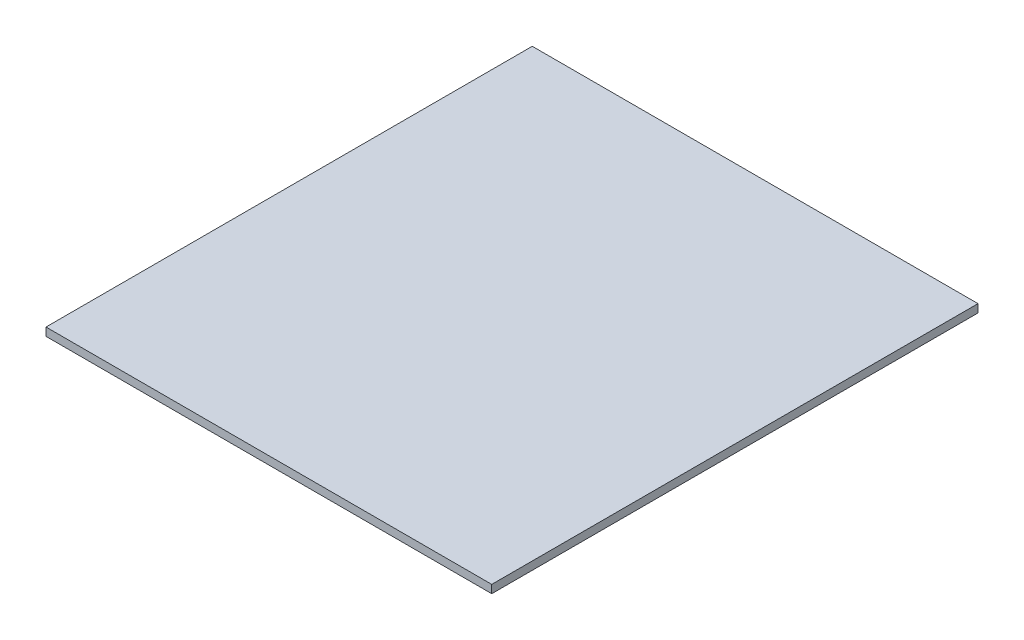
ISO-10303-21;
HEADER;
FILE_DESCRIPTION(('STEP AP214'),'2;1');
FILE_NAME('part.step','',(''),(''),'','','');
FILE_SCHEMA(('AUTOMOTIVE_DESIGN { 1 0 10303 214 1 1 1 1 }'));
ENDSEC;
DATA;
#1=APPLICATION_CONTEXT('core data for automotive mechanical design processes');
#2=APPLICATION_PROTOCOL_DEFINITION('international standard','automotive_design',2000,#1);
#3=PRODUCT_CONTEXT('',#1,'mechanical');
#4=PRODUCT('Part','Part','',(#3));
#5=PRODUCT_RELATED_PRODUCT_CATEGORY('part','',(#4));
#6=PRODUCT_DEFINITION_FORMATION('','',#4);
#7=PRODUCT_DEFINITION_CONTEXT('part definition',#1,'design');
#8=PRODUCT_DEFINITION('design','',#6,#7);
#9=PRODUCT_DEFINITION_SHAPE('','',#8);
#10=(LENGTH_UNIT() NAMED_UNIT(*) SI_UNIT(.MILLI.,.METRE.));
#11=(NAMED_UNIT(*) PLANE_ANGLE_UNIT() SI_UNIT($,.RADIAN.));
#12=(NAMED_UNIT(*) SI_UNIT($,.STERADIAN.) SOLID_ANGLE_UNIT());
#13=UNCERTAINTY_MEASURE_WITH_UNIT(LENGTH_MEASURE(1.E-05),#10,'distance_accuracy_value','');
#14=(GEOMETRIC_REPRESENTATION_CONTEXT(3) GLOBAL_UNCERTAINTY_ASSIGNED_CONTEXT((#13)) GLOBAL_UNIT_ASSIGNED_CONTEXT((#10,
#11,#12)) REPRESENTATION_CONTEXT('',''));
#15=CARTESIAN_POINT('',(0.,0.,0.));
#16=DIRECTION('',(0.,0.,1.));
#17=DIRECTION('',(1.,0.,0.));
#18=AXIS2_PLACEMENT_3D('',#15,#16,#17);
#19=CARTESIAN_POINT('',(55.,2.,-60.));
#20=DIRECTION('',(-1.,0.,0.));
#21=DIRECTION('',(0.,0.,1.));
#22=AXIS2_PLACEMENT_3D('',#19,#20,#21);
#23=PLANE('',#22);
#24=DIRECTION('',(0.,0.,-1.));
#25=VECTOR('',#24,1.);
#26=CARTESIAN_POINT('',(55.,0.,-60.));
#27=LINE('',#26,#25);
#28=CARTESIAN_POINT('',(55.,0.,60.));
#29=VERTEX_POINT('',#28);
#30=CARTESIAN_POINT('',(55.,0.,-60.));
#31=VERTEX_POINT('',#30);
#32=EDGE_CURVE('E98',#29,#31,#27,.T.);
#33=ORIENTED_EDGE('',*,*,#32,.T.);
#34=DIRECTION('',(0.,-1.,0.));
#35=VECTOR('',#34,1.);
#36=CARTESIAN_POINT('',(55.,2.,-60.));
#37=LINE('',#36,#35);
#38=CARTESIAN_POINT('',(55.,2.,-60.));
#39=VERTEX_POINT('',#38);
#40=EDGE_CURVE('E11',#39,#31,#37,.T.);
#41=ORIENTED_EDGE('',*,*,#40,.F.);
#42=DIRECTION('',(0.,0.,-1.));
#43=VECTOR('',#42,1.);
#44=CARTESIAN_POINT('',(55.,2.,-60.));
#45=LINE('',#44,#43);
#46=CARTESIAN_POINT('',(55.,2.,60.));
#47=VERTEX_POINT('',#46);
#48=EDGE_CURVE('E86',#47,#39,#45,.T.);
#49=ORIENTED_EDGE('',*,*,#48,.F.);
#50=DIRECTION('',(0.,-1.,0.));
#51=VECTOR('',#50,1.);
#52=CARTESIAN_POINT('',(55.,2.,60.));
#53=LINE('',#52,#51);
#54=EDGE_CURVE('E94',#47,#29,#53,.T.);
#55=ORIENTED_EDGE('',*,*,#54,.T.);
#56=EDGE_LOOP('',(#33,#41,#49,#55));
#57=FACE_BOUND('',#56,.T.);
#58=ADVANCED_FACE('F35',(#57),#23,.F.);
#59=CARTESIAN_POINT('',(-55.,2.,-60.));
#60=DIRECTION('',(0.,0.,1.));
#61=DIRECTION('',(1.,0.,0.));
#62=AXIS2_PLACEMENT_3D('',#59,#60,#61);
#63=PLANE('',#62);
#64=DIRECTION('',(-1.,0.,0.));
#65=VECTOR('',#64,1.);
#66=CARTESIAN_POINT('',(-55.,0.,-60.));
#67=LINE('',#66,#65);
#68=CARTESIAN_POINT('',(-55.,0.,-60.));
#69=VERTEX_POINT('',#68);
#70=EDGE_CURVE('E90',#31,#69,#67,.T.);
#71=ORIENTED_EDGE('',*,*,#70,.T.);
#72=DIRECTION('',(0.,-1.,0.));
#73=VECTOR('',#72,1.);
#74=CARTESIAN_POINT('',(-55.,2.,-60.));
#75=LINE('',#74,#73);
#76=CARTESIAN_POINT('',(-55.,2.,-60.));
#77=VERTEX_POINT('',#76);
#78=EDGE_CURVE('E43',#77,#69,#75,.T.);
#79=ORIENTED_EDGE('',*,*,#78,.F.);
#80=DIRECTION('',(-1.,0.,0.));
#81=VECTOR('',#80,1.);
#82=CARTESIAN_POINT('',(-55.,2.,-60.));
#83=LINE('',#82,#81);
#84=EDGE_CURVE('E81',#39,#77,#83,.T.);
#85=ORIENTED_EDGE('',*,*,#84,.F.);
#86=ORIENTED_EDGE('',*,*,#40,.T.);
#87=EDGE_LOOP('',(#71,#79,#85,#86));
#88=FACE_BOUND('',#87,.T.);
#89=ADVANCED_FACE('F89',(#88),#63,.F.);
#90=CARTESIAN_POINT('',(-55.,2.,-60.));
#91=DIRECTION('',(1.,0.,0.));
#92=DIRECTION('',(0.,0.,-1.));
#93=AXIS2_PLACEMENT_3D('',#90,#91,#92);
#94=PLANE('',#93);
#95=DIRECTION('',(0.,0.,1.));
#96=VECTOR('',#95,1.);
#97=CARTESIAN_POINT('',(-55.,0.,-60.));
#98=LINE('',#97,#96);
#99=CARTESIAN_POINT('',(-55.,0.,60.));
#100=VERTEX_POINT('',#99);
#101=EDGE_CURVE('E68',#69,#100,#98,.T.);
#102=ORIENTED_EDGE('',*,*,#101,.T.);
#103=DIRECTION('',(0.,-1.,0.));
#104=VECTOR('',#103,1.);
#105=CARTESIAN_POINT('',(-55.,2.,60.));
#106=LINE('',#105,#104);
#107=CARTESIAN_POINT('',(-55.,2.,60.));
#108=VERTEX_POINT('',#107);
#109=EDGE_CURVE('E91',#108,#100,#106,.T.);
#110=ORIENTED_EDGE('',*,*,#109,.F.);
#111=DIRECTION('',(0.,0.,1.));
#112=VECTOR('',#111,1.);
#113=CARTESIAN_POINT('',(-55.,2.,-60.));
#114=LINE('',#113,#112);
#115=EDGE_CURVE('E84',#77,#108,#114,.T.);
#116=ORIENTED_EDGE('',*,*,#115,.F.);
#117=ORIENTED_EDGE('',*,*,#78,.T.);
#118=EDGE_LOOP('',(#102,#110,#116,#117));
#119=FACE_BOUND('',#118,.T.);
#120=ADVANCED_FACE('F92',(#119),#94,.F.);
#121=CARTESIAN_POINT('',(-55.,2.,60.));
#122=DIRECTION('',(0.,0.,-1.));
#123=DIRECTION('',(-1.,0.,0.));
#124=AXIS2_PLACEMENT_3D('',#121,#122,#123);
#125=PLANE('',#124);
#126=DIRECTION('',(1.,0.,0.));
#127=VECTOR('',#126,1.);
#128=CARTESIAN_POINT('',(-55.,0.,60.));
#129=LINE('',#128,#127);
#130=EDGE_CURVE('E74',#100,#29,#129,.T.);
#131=ORIENTED_EDGE('',*,*,#130,.T.);
#132=ORIENTED_EDGE('',*,*,#54,.F.);
#133=DIRECTION('',(1.,0.,0.));
#134=VECTOR('',#133,1.);
#135=CARTESIAN_POINT('',(-55.,2.,60.));
#136=LINE('',#135,#134);
#137=EDGE_CURVE('E51',#108,#47,#136,.T.);
#138=ORIENTED_EDGE('',*,*,#137,.F.);
#139=ORIENTED_EDGE('',*,*,#109,.T.);
#140=EDGE_LOOP('',(#131,#132,#138,#139));
#141=FACE_BOUND('',#140,.T.);
#142=ADVANCED_FACE('F105',(#141),#125,.F.);
#143=CARTESIAN_POINT('',(0.,2.,0.));
#144=DIRECTION('',(0.,1.,0.));
#145=DIRECTION('',(0.,0.,1.));
#146=AXIS2_PLACEMENT_3D('',#143,#144,#145);
#147=PLANE('',#146);
#148=ORIENTED_EDGE('',*,*,#48,.T.);
#149=ORIENTED_EDGE('',*,*,#84,.T.);
#150=ORIENTED_EDGE('',*,*,#115,.T.);
#151=ORIENTED_EDGE('',*,*,#137,.T.);
#152=EDGE_LOOP('',(#148,#149,#150,#151));
#153=FACE_BOUND('',#152,.T.);
#154=ADVANCED_FACE('F82',(#153),#147,.T.);
#155=CARTESIAN_POINT('',(0.,0.,0.));
#156=DIRECTION('',(0.,1.,0.));
#157=DIRECTION('',(0.,0.,1.));
#158=AXIS2_PLACEMENT_3D('',#155,#156,#157);
#159=PLANE('',#158);
#160=ORIENTED_EDGE('',*,*,#32,.F.);
#161=ORIENTED_EDGE('',*,*,#130,.F.);
#162=ORIENTED_EDGE('',*,*,#101,.F.);
#163=ORIENTED_EDGE('',*,*,#70,.F.);
#164=EDGE_LOOP('',(#160,#161,#162,#163));
#165=FACE_BOUND('',#164,.T.);
#166=ADVANCED_FACE('F108',(#165),#159,.F.);
#167=CLOSED_SHELL('',(#58,#89,#120,#142,#154,#166));
#168=MANIFOLD_SOLID_BREP('B2',#167);
#169=ADVANCED_BREP_SHAPE_REPRESENTATION('',(#18,#168),#14);
#170=SHAPE_DEFINITION_REPRESENTATION(#9,#169);
ENDSEC;
END-ISO-10303-21;
